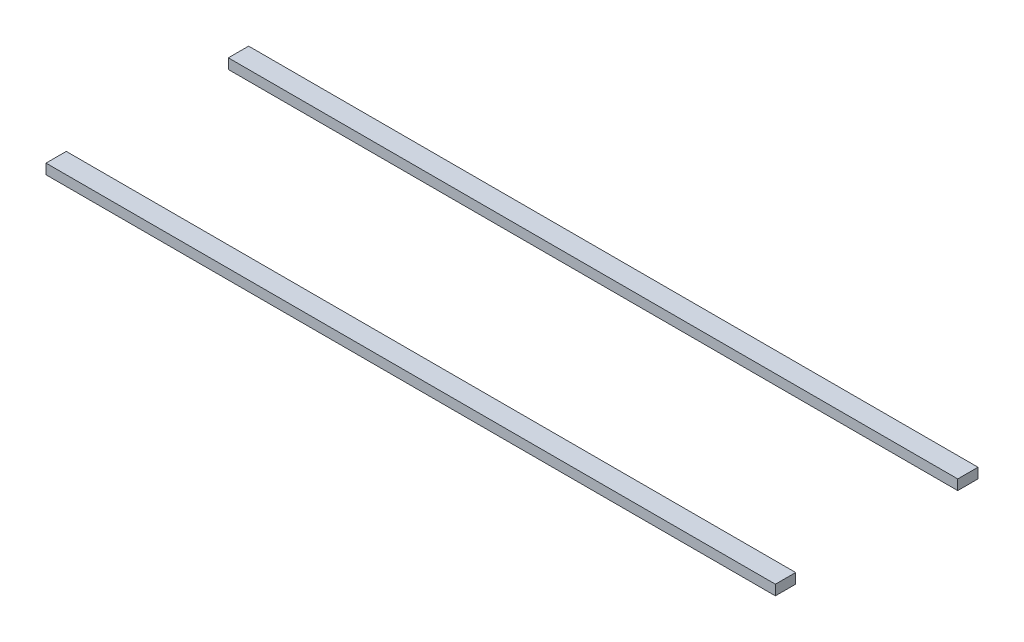
ISO-10303-21;
HEADER;
FILE_DESCRIPTION(('STEP AP214'),'2;1');
FILE_NAME('part.step','',(''),(''),'','','');
FILE_SCHEMA(('AUTOMOTIVE_DESIGN { 1 0 10303 214 1 1 1 1 }'));
ENDSEC;
DATA;
#1=APPLICATION_CONTEXT('core data for automotive mechanical design processes');
#2=APPLICATION_PROTOCOL_DEFINITION('international standard','automotive_design',2000,#1);
#3=PRODUCT_CONTEXT('',#1,'mechanical');
#4=PRODUCT('Part','Part','',(#3));
#5=PRODUCT_RELATED_PRODUCT_CATEGORY('part','',(#4));
#6=PRODUCT_DEFINITION_FORMATION('','',#4);
#7=PRODUCT_DEFINITION_CONTEXT('part definition',#1,'design');
#8=PRODUCT_DEFINITION('design','',#6,#7);
#9=PRODUCT_DEFINITION_SHAPE('','',#8);
#10=(LENGTH_UNIT() NAMED_UNIT(*) SI_UNIT(.MILLI.,.METRE.));
#11=(NAMED_UNIT(*) PLANE_ANGLE_UNIT() SI_UNIT($,.RADIAN.));
#12=(NAMED_UNIT(*) SI_UNIT($,.STERADIAN.) SOLID_ANGLE_UNIT());
#13=UNCERTAINTY_MEASURE_WITH_UNIT(LENGTH_MEASURE(1.E-05),#10,'distance_accuracy_value','');
#14=(GEOMETRIC_REPRESENTATION_CONTEXT(3) GLOBAL_UNCERTAINTY_ASSIGNED_CONTEXT((#13)) GLOBAL_UNIT_ASSIGNED_CONTEXT((#10,
#11,#12)) REPRESENTATION_CONTEXT('',''));
#15=CARTESIAN_POINT('',(0.,0.,0.));
#16=DIRECTION('',(0.,0.,1.));
#17=DIRECTION('',(1.,0.,0.));
#18=AXIS2_PLACEMENT_3D('',#15,#16,#17);
#19=CARTESIAN_POINT('',(0.,3.81,-38.1));
#20=DIRECTION('',(0.,0.,1.));
#21=DIRECTION('',(1.,0.,0.));
#22=AXIS2_PLACEMENT_3D('',#19,#20,#21);
#23=PLANE('',#22);
#24=DIRECTION('',(-1.,0.,0.));
#25=VECTOR('',#24,1.);
#26=CARTESIAN_POINT('',(0.,0.,-38.1));
#27=LINE('',#26,#25);
#28=CARTESIAN_POINT('',(137.16,0.,-38.1));
#29=VERTEX_POINT('',#28);
#30=CARTESIAN_POINT('',(-137.16,0.,-38.1));
#31=VERTEX_POINT('',#30);
#32=EDGE_CURVE('E112',#29,#31,#27,.T.);
#33=ORIENTED_EDGE('',*,*,#32,.T.);
#34=DIRECTION('',(0.,-1.,0.));
#35=VECTOR('',#34,1.);
#36=CARTESIAN_POINT('',(-137.16,3.81,-38.1));
#37=LINE('',#36,#35);
#38=CARTESIAN_POINT('',(-137.16,3.81,-38.1));
#39=VERTEX_POINT('',#38);
#40=EDGE_CURVE('E12',#39,#31,#37,.T.);
#41=ORIENTED_EDGE('',*,*,#40,.F.);
#42=DIRECTION('',(-1.,0.,0.));
#43=VECTOR('',#42,1.);
#44=CARTESIAN_POINT('',(0.,3.81,-38.1));
#45=LINE('',#44,#43);
#46=CARTESIAN_POINT('',(137.16,3.81,-38.1));
#47=VERTEX_POINT('',#46);
#48=EDGE_CURVE('E98',#47,#39,#45,.T.);
#49=ORIENTED_EDGE('',*,*,#48,.F.);
#50=DIRECTION('',(0.,-1.,0.));
#51=VECTOR('',#50,1.);
#52=CARTESIAN_POINT('',(137.16,3.81,-38.1));
#53=LINE('',#52,#51);
#54=EDGE_CURVE('E65',#47,#29,#53,.T.);
#55=ORIENTED_EDGE('',*,*,#54,.T.);
#56=EDGE_LOOP('',(#33,#41,#49,#55));
#57=FACE_BOUND('',#56,.T.);
#58=ADVANCED_FACE('F49',(#57),#23,.F.);
#59=CARTESIAN_POINT('',(-137.16,3.81,0.));
#60=DIRECTION('',(1.,0.,0.));
#61=DIRECTION('',(0.,0.,-1.));
#62=AXIS2_PLACEMENT_3D('',#59,#60,#61);
#63=PLANE('',#62);
#64=DIRECTION('',(0.,0.,1.));
#65=VECTOR('',#64,1.);
#66=CARTESIAN_POINT('',(-137.16,0.,0.));
#67=LINE('',#66,#65);
#68=CARTESIAN_POINT('',(-137.16,0.,-30.48));
#69=VERTEX_POINT('',#68);
#70=EDGE_CURVE('E103',#31,#69,#67,.T.);
#71=ORIENTED_EDGE('',*,*,#70,.T.);
#72=DIRECTION('',(0.,-1.,0.));
#73=VECTOR('',#72,1.);
#74=CARTESIAN_POINT('',(-137.16,3.81,-30.48));
#75=LINE('',#74,#73);
#76=CARTESIAN_POINT('',(-137.16,3.81,-30.48));
#77=VERTEX_POINT('',#76);
#78=EDGE_CURVE('E57',#77,#69,#75,.T.);
#79=ORIENTED_EDGE('',*,*,#78,.F.);
#80=DIRECTION('',(0.,0.,1.));
#81=VECTOR('',#80,1.);
#82=CARTESIAN_POINT('',(-137.16,3.81,0.));
#83=LINE('',#82,#81);
#84=EDGE_CURVE('E91',#39,#77,#83,.T.);
#85=ORIENTED_EDGE('',*,*,#84,.F.);
#86=ORIENTED_EDGE('',*,*,#40,.T.);
#87=EDGE_LOOP('',(#71,#79,#85,#86));
#88=FACE_BOUND('',#87,.T.);
#89=ADVANCED_FACE('F102',(#88),#63,.F.);
#90=CARTESIAN_POINT('',(0.,3.81,-30.48));
#91=DIRECTION('',(0.,0.,-1.));
#92=DIRECTION('',(-1.,0.,0.));
#93=AXIS2_PLACEMENT_3D('',#90,#91,#92);
#94=PLANE('',#93);
#95=DIRECTION('',(1.,0.,0.));
#96=VECTOR('',#95,1.);
#97=CARTESIAN_POINT('',(0.,0.,-30.48));
#98=LINE('',#97,#96);
#99=CARTESIAN_POINT('',(137.16,0.,-30.48));
#100=VERTEX_POINT('',#99);
#101=EDGE_CURVE('E115',#69,#100,#98,.T.);
#102=ORIENTED_EDGE('',*,*,#101,.T.);
#103=DIRECTION('',(0.,-1.,0.));
#104=VECTOR('',#103,1.);
#105=CARTESIAN_POINT('',(137.16,3.81,-30.48));
#106=LINE('',#105,#104);
#107=CARTESIAN_POINT('',(137.16,3.81,-30.48));
#108=VERTEX_POINT('',#107);
#109=EDGE_CURVE('E80',#108,#100,#106,.T.);
#110=ORIENTED_EDGE('',*,*,#109,.F.);
#111=DIRECTION('',(1.,0.,0.));
#112=VECTOR('',#111,1.);
#113=CARTESIAN_POINT('',(0.,3.81,-30.48));
#114=LINE('',#113,#112);
#115=EDGE_CURVE('E97',#77,#108,#114,.T.);
#116=ORIENTED_EDGE('',*,*,#115,.F.);
#117=ORIENTED_EDGE('',*,*,#78,.T.);
#118=EDGE_LOOP('',(#102,#110,#116,#117));
#119=FACE_BOUND('',#118,.T.);
#120=ADVANCED_FACE('F106',(#119),#94,.F.);
#121=CARTESIAN_POINT('',(137.16,3.81,0.));
#122=DIRECTION('',(1.,0.,0.));
#123=DIRECTION('',(0.,0.,-1.));
#124=AXIS2_PLACEMENT_3D('',#121,#122,#123);
#125=PLANE('',#124);
#126=DIRECTION('',(0.,0.,1.));
#127=VECTOR('',#126,1.);
#128=CARTESIAN_POINT('',(137.16,0.,0.));
#129=LINE('',#128,#127);
#130=EDGE_CURVE('E117',#29,#100,#129,.T.);
#131=ORIENTED_EDGE('',*,*,#130,.F.);
#132=ORIENTED_EDGE('',*,*,#54,.F.);
#133=DIRECTION('',(0.,0.,1.));
#134=VECTOR('',#133,1.);
#135=CARTESIAN_POINT('',(137.16,3.81,0.));
#136=LINE('',#135,#134);
#137=EDGE_CURVE('E107',#47,#108,#136,.T.);
#138=ORIENTED_EDGE('',*,*,#137,.T.);
#139=ORIENTED_EDGE('',*,*,#109,.T.);
#140=EDGE_LOOP('',(#131,#132,#138,#139));
#141=FACE_BOUND('',#140,.T.);
#142=ADVANCED_FACE('F123',(#141),#125,.T.);
#143=CARTESIAN_POINT('',(0.,3.81,0.));
#144=DIRECTION('',(0.,1.,0.));
#145=DIRECTION('',(0.,0.,1.));
#146=AXIS2_PLACEMENT_3D('',#143,#144,#145);
#147=PLANE('',#146);
#148=ORIENTED_EDGE('',*,*,#48,.T.);
#149=ORIENTED_EDGE('',*,*,#84,.T.);
#150=ORIENTED_EDGE('',*,*,#115,.T.);
#151=ORIENTED_EDGE('',*,*,#137,.F.);
#152=EDGE_LOOP('',(#148,#149,#150,#151));
#153=FACE_BOUND('',#152,.T.);
#154=ADVANCED_FACE('F94',(#153),#147,.T.);
#155=CARTESIAN_POINT('',(0.,0.,0.));
#156=DIRECTION('',(0.,1.,0.));
#157=DIRECTION('',(0.,0.,1.));
#158=AXIS2_PLACEMENT_3D('',#155,#156,#157);
#159=PLANE('',#158);
#160=ORIENTED_EDGE('',*,*,#32,.F.);
#161=ORIENTED_EDGE('',*,*,#130,.T.);
#162=ORIENTED_EDGE('',*,*,#101,.F.);
#163=ORIENTED_EDGE('',*,*,#70,.F.);
#164=EDGE_LOOP('',(#160,#161,#162,#163));
#165=FACE_BOUND('',#164,.T.);
#166=ADVANCED_FACE('F122',(#165),#159,.F.);
#167=CLOSED_SHELL('',(#58,#89,#120,#142,#154,#166));
#168=MANIFOLD_SOLID_BREP('B2',#167);
#169=CARTESIAN_POINT('',(0.,3.81,30.48));
#170=DIRECTION('',(0.,0.,-1.));
#171=DIRECTION('',(-1.,0.,0.));
#172=AXIS2_PLACEMENT_3D('',#169,#170,#171);
#173=PLANE('',#172);
#174=DIRECTION('',(1.,0.,0.));
#175=VECTOR('',#174,1.);
#176=CARTESIAN_POINT('',(0.,0.,30.48));
#177=LINE('',#176,#175);
#178=CARTESIAN_POINT('',(-137.16,0.,30.48));
#179=VERTEX_POINT('',#178);
#180=CARTESIAN_POINT('',(137.16,0.,30.48));
#181=VERTEX_POINT('',#180);
#182=EDGE_CURVE('E248',#179,#181,#177,.T.);
#183=ORIENTED_EDGE('',*,*,#182,.F.);
#184=DIRECTION('',(0.,-1.,0.));
#185=VECTOR('',#184,1.);
#186=CARTESIAN_POINT('',(-137.16,3.81,30.48));
#187=LINE('',#186,#185);
#188=CARTESIAN_POINT('',(-137.16,3.81,30.48));
#189=VERTEX_POINT('',#188);
#190=EDGE_CURVE('E47',#189,#179,#187,.T.);
#191=ORIENTED_EDGE('',*,*,#190,.F.);
#192=DIRECTION('',(1.,0.,0.));
#193=VECTOR('',#192,1.);
#194=CARTESIAN_POINT('',(0.,3.81,30.48));
#195=LINE('',#194,#193);
#196=CARTESIAN_POINT('',(137.16,3.81,30.48));
#197=VERTEX_POINT('',#196);
#198=EDGE_CURVE('E233',#189,#197,#195,.T.);
#199=ORIENTED_EDGE('',*,*,#198,.T.);
#200=DIRECTION('',(0.,-1.,0.));
#201=VECTOR('',#200,1.);
#202=CARTESIAN_POINT('',(137.16,3.81,30.48));
#203=LINE('',#202,#201);
#204=EDGE_CURVE('E201',#197,#181,#203,.T.);
#205=ORIENTED_EDGE('',*,*,#204,.T.);
#206=EDGE_LOOP('',(#183,#191,#199,#205));
#207=FACE_BOUND('',#206,.T.);
#208=ADVANCED_FACE('F185',(#207),#173,.T.);
#209=CARTESIAN_POINT('',(-137.16,3.81,0.));
#210=DIRECTION('',(1.,0.,0.));
#211=DIRECTION('',(0.,0.,-1.));
#212=AXIS2_PLACEMENT_3D('',#209,#210,#211);
#213=PLANE('',#212);
#214=DIRECTION('',(0.,0.,1.));
#215=VECTOR('',#214,1.);
#216=CARTESIAN_POINT('',(-137.16,0.,0.));
#217=LINE('',#216,#215);
#218=CARTESIAN_POINT('',(-137.16,0.,38.1));
#219=VERTEX_POINT('',#218);
#220=EDGE_CURVE('E239',#179,#219,#217,.T.);
#221=ORIENTED_EDGE('',*,*,#220,.T.);
#222=DIRECTION('',(0.,-1.,0.));
#223=VECTOR('',#222,1.);
#224=CARTESIAN_POINT('',(-137.16,3.81,38.1));
#225=LINE('',#224,#223);
#226=CARTESIAN_POINT('',(-137.16,3.81,38.1));
#227=VERTEX_POINT('',#226);
#228=EDGE_CURVE('E193',#227,#219,#225,.T.);
#229=ORIENTED_EDGE('',*,*,#228,.F.);
#230=DIRECTION('',(0.,0.,1.));
#231=VECTOR('',#230,1.);
#232=CARTESIAN_POINT('',(-137.16,3.81,0.));
#233=LINE('',#232,#231);
#234=EDGE_CURVE('E227',#189,#227,#233,.T.);
#235=ORIENTED_EDGE('',*,*,#234,.F.);
#236=ORIENTED_EDGE('',*,*,#190,.T.);
#237=EDGE_LOOP('',(#221,#229,#235,#236));
#238=FACE_BOUND('',#237,.T.);
#239=ADVANCED_FACE('F237',(#238),#213,.F.);
#240=CARTESIAN_POINT('',(0.,3.81,38.1));
#241=DIRECTION('',(0.,0.,1.));
#242=DIRECTION('',(1.,0.,0.));
#243=AXIS2_PLACEMENT_3D('',#240,#241,#242);
#244=PLANE('',#243);
#245=DIRECTION('',(-1.,0.,0.));
#246=VECTOR('',#245,1.);
#247=CARTESIAN_POINT('',(0.,0.,38.1));
#248=LINE('',#247,#246);
#249=CARTESIAN_POINT('',(137.16,0.,38.1));
#250=VERTEX_POINT('',#249);
#251=EDGE_CURVE('E251',#250,#219,#248,.T.);
#252=ORIENTED_EDGE('',*,*,#251,.F.);
#253=DIRECTION('',(0.,-1.,0.));
#254=VECTOR('',#253,1.);
#255=CARTESIAN_POINT('',(137.16,3.81,38.1));
#256=LINE('',#255,#254);
#257=CARTESIAN_POINT('',(137.16,3.81,38.1));
#258=VERTEX_POINT('',#257);
#259=EDGE_CURVE('E214',#258,#250,#256,.T.);
#260=ORIENTED_EDGE('',*,*,#259,.F.);
#261=DIRECTION('',(-1.,0.,0.));
#262=VECTOR('',#261,1.);
#263=CARTESIAN_POINT('',(0.,3.81,38.1));
#264=LINE('',#263,#262);
#265=EDGE_CURVE('E232',#258,#227,#264,.T.);
#266=ORIENTED_EDGE('',*,*,#265,.T.);
#267=ORIENTED_EDGE('',*,*,#228,.T.);
#268=EDGE_LOOP('',(#252,#260,#266,#267));
#269=FACE_BOUND('',#268,.T.);
#270=ADVANCED_FACE('F242',(#269),#244,.T.);
#271=CARTESIAN_POINT('',(137.16,3.81,0.));
#272=DIRECTION('',(1.,0.,0.));
#273=DIRECTION('',(0.,0.,-1.));
#274=AXIS2_PLACEMENT_3D('',#271,#272,#273);
#275=PLANE('',#274);
#276=DIRECTION('',(0.,0.,1.));
#277=VECTOR('',#276,1.);
#278=CARTESIAN_POINT('',(137.16,0.,0.));
#279=LINE('',#278,#277);
#280=EDGE_CURVE('E253',#181,#250,#279,.T.);
#281=ORIENTED_EDGE('',*,*,#280,.F.);
#282=ORIENTED_EDGE('',*,*,#204,.F.);
#283=DIRECTION('',(0.,0.,1.));
#284=VECTOR('',#283,1.);
#285=CARTESIAN_POINT('',(137.16,3.81,0.));
#286=LINE('',#285,#284);
#287=EDGE_CURVE('E243',#197,#258,#286,.T.);
#288=ORIENTED_EDGE('',*,*,#287,.T.);
#289=ORIENTED_EDGE('',*,*,#259,.T.);
#290=EDGE_LOOP('',(#281,#282,#288,#289));
#291=FACE_BOUND('',#290,.T.);
#292=ADVANCED_FACE('F258',(#291),#275,.T.);
#293=CARTESIAN_POINT('',(0.,3.81,0.));
#294=DIRECTION('',(0.,1.,0.));
#295=DIRECTION('',(0.,0.,1.));
#296=AXIS2_PLACEMENT_3D('',#293,#294,#295);
#297=PLANE('',#296);
#298=ORIENTED_EDGE('',*,*,#198,.F.);
#299=ORIENTED_EDGE('',*,*,#234,.T.);
#300=ORIENTED_EDGE('',*,*,#265,.F.);
#301=ORIENTED_EDGE('',*,*,#287,.F.);
#302=EDGE_LOOP('',(#298,#299,#300,#301));
#303=FACE_BOUND('',#302,.T.);
#304=ADVANCED_FACE('F229',(#303),#297,.T.);
#305=CARTESIAN_POINT('',(0.,0.,0.));
#306=DIRECTION('',(0.,1.,0.));
#307=DIRECTION('',(0.,0.,1.));
#308=AXIS2_PLACEMENT_3D('',#305,#306,#307);
#309=PLANE('',#308);
#310=ORIENTED_EDGE('',*,*,#182,.T.);
#311=ORIENTED_EDGE('',*,*,#280,.T.);
#312=ORIENTED_EDGE('',*,*,#251,.T.);
#313=ORIENTED_EDGE('',*,*,#220,.F.);
#314=EDGE_LOOP('',(#310,#311,#312,#313));
#315=FACE_BOUND('',#314,.T.);
#316=ADVANCED_FACE('F265',(#315),#309,.F.);
#317=CLOSED_SHELL('',(#208,#239,#270,#292,#304,#316));
#318=MANIFOLD_SOLID_BREP('B6',#317);
#319=ADVANCED_BREP_SHAPE_REPRESENTATION('',(#18,#168,#318),#14);
#320=SHAPE_DEFINITION_REPRESENTATION(#9,#319);
ENDSEC;
END-ISO-10303-21;
